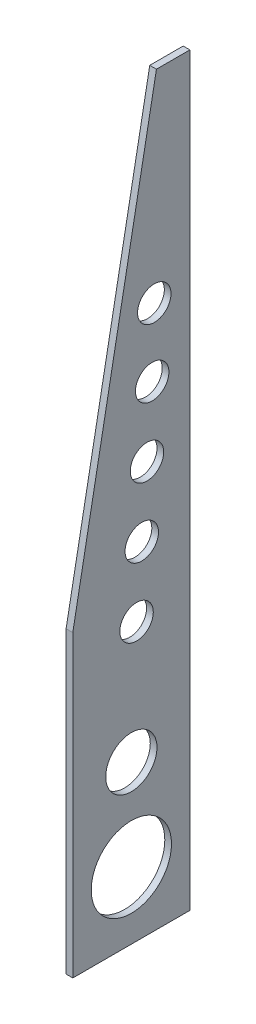
ISO-10303-21;
HEADER;
FILE_DESCRIPTION(('STEP AP214'),'2;1');
FILE_NAME('part.step','',(''),(''),'','','');
FILE_SCHEMA(('AUTOMOTIVE_DESIGN { 1 0 10303 214 1 1 1 1 }'));
ENDSEC;
DATA;
#1=APPLICATION_CONTEXT('core data for automotive mechanical design processes');
#2=APPLICATION_PROTOCOL_DEFINITION('international standard','automotive_design',2000,#1);
#3=PRODUCT_CONTEXT('',#1,'mechanical');
#4=PRODUCT('Part','Part','',(#3));
#5=PRODUCT_RELATED_PRODUCT_CATEGORY('part','',(#4));
#6=PRODUCT_DEFINITION_FORMATION('','',#4);
#7=PRODUCT_DEFINITION_CONTEXT('part definition',#1,'design');
#8=PRODUCT_DEFINITION('design','',#6,#7);
#9=PRODUCT_DEFINITION_SHAPE('','',#8);
#10=(LENGTH_UNIT() NAMED_UNIT(*) SI_UNIT(.MILLI.,.METRE.));
#11=(NAMED_UNIT(*) PLANE_ANGLE_UNIT() SI_UNIT($,.RADIAN.));
#12=(NAMED_UNIT(*) SI_UNIT($,.STERADIAN.) SOLID_ANGLE_UNIT());
#13=UNCERTAINTY_MEASURE_WITH_UNIT(LENGTH_MEASURE(1.E-05),#10,'distance_accuracy_value','');
#14=(GEOMETRIC_REPRESENTATION_CONTEXT(3) GLOBAL_UNCERTAINTY_ASSIGNED_CONTEXT((#13)) GLOBAL_UNIT_ASSIGNED_CONTEXT((#10,
#11,#12)) REPRESENTATION_CONTEXT('',''));
#15=CARTESIAN_POINT('',(0.,0.,0.));
#16=DIRECTION('',(0.,0.,1.));
#17=DIRECTION('',(1.,0.,0.));
#18=AXIS2_PLACEMENT_3D('',#15,#16,#17);
#19=CARTESIAN_POINT('',(2.54,1.2665581807014E-13,-211.819533938193));
#20=DIRECTION('',(0.,0.,-1.));
#21=DIRECTION('',(0.,1.,0.));
#22=AXIS2_PLACEMENT_3D('',#19,#20,#21);
#23=PLANE('',#22);
#24=DIRECTION('',(0.,-1.,0.));
#25=VECTOR('',#24,1.);
#26=CARTESIAN_POINT('',(0.,1.2665581807014E-13,-211.819533938193));
#27=LINE('',#26,#25);
#28=CARTESIAN_POINT('',(0.,257.309346266829,-211.819533938193));
#29=VERTEX_POINT('',#28);
#30=CARTESIAN_POINT('',(0.,76.0168462668287,-211.819533938193));
#31=VERTEX_POINT('',#30);
#32=EDGE_CURVE('E156',#29,#31,#27,.T.);
#33=ORIENTED_EDGE('',*,*,#32,.F.);
#34=DIRECTION('',(1.,0.,0.));
#35=VECTOR('',#34,1.);
#36=CARTESIAN_POINT('',(2.54,257.309346266829,-211.819533938193));
#37=LINE('',#36,#35);
#38=CARTESIAN_POINT('',(2.54,257.309346266829,-211.819533938193));
#39=VERTEX_POINT('',#38);
#40=EDGE_CURVE('E11',#29,#39,#37,.T.);
#41=ORIENTED_EDGE('',*,*,#40,.T.);
#42=DIRECTION('',(0.,-1.,0.));
#43=VECTOR('',#42,1.);
#44=CARTESIAN_POINT('',(2.54,1.2665581807014E-13,-211.819533938193));
#45=LINE('',#44,#43);
#46=CARTESIAN_POINT('',(2.54,76.0168462668287,-211.819533938193));
#47=VERTEX_POINT('',#46);
#48=EDGE_CURVE('E123',#39,#47,#45,.T.);
#49=ORIENTED_EDGE('',*,*,#48,.T.);
#50=DIRECTION('',(-1.,0.,0.));
#51=VECTOR('',#50,1.);
#52=CARTESIAN_POINT('',(2.54,76.0168462668287,-211.819533938193));
#53=LINE('',#52,#51);
#54=EDGE_CURVE('E162',#47,#31,#53,.T.);
#55=ORIENTED_EDGE('',*,*,#54,.T.);
#56=EDGE_LOOP('',(#33,#41,#49,#55));
#57=FACE_BOUND('',#56,.T.);
#58=ADVANCED_FACE('F39',(#57),#23,.T.);
#59=CARTESIAN_POINT('',(2.54,358.909346266829,0.));
#60=DIRECTION('',(0.,1.,0.));
#61=DIRECTION('',(0.,0.,1.));
#62=AXIS2_PLACEMENT_3D('',#59,#60,#61);
#63=PLANE('',#62);
#64=DIRECTION('',(0.,0.,-1.));
#65=VECTOR('',#64,1.);
#66=CARTESIAN_POINT('',(0.,358.909346266829,0.));
#67=LINE('',#66,#65);
#68=CARTESIAN_POINT('',(0.,358.909346266829,-199.119533938193));
#69=VERTEX_POINT('',#68);
#70=CARTESIAN_POINT('',(0.,358.909346266829,-211.819533938193));
#71=VERTEX_POINT('',#70);
#72=EDGE_CURVE('E96',#69,#71,#67,.T.);
#73=ORIENTED_EDGE('',*,*,#72,.F.);
#74=DIRECTION('',(-1.,0.,0.));
#75=VECTOR('',#74,1.);
#76=CARTESIAN_POINT('',(2.54,358.909346266829,-199.119533938193));
#77=LINE('',#76,#75);
#78=CARTESIAN_POINT('',(2.54,358.909346266829,-199.119533938193));
#79=VERTEX_POINT('',#78);
#80=EDGE_CURVE('E48',#79,#69,#77,.T.);
#81=ORIENTED_EDGE('',*,*,#80,.F.);
#82=DIRECTION('',(0.,0.,-1.));
#83=VECTOR('',#82,1.);
#84=CARTESIAN_POINT('',(2.54,358.909346266829,0.));
#85=LINE('',#84,#83);
#86=CARTESIAN_POINT('',(2.54,358.909346266829,-211.819533938193));
#87=VERTEX_POINT('',#86);
#88=EDGE_CURVE('E93',#79,#87,#85,.T.);
#89=ORIENTED_EDGE('',*,*,#88,.T.);
#90=DIRECTION('',(-1.,0.,0.));
#91=VECTOR('',#90,1.);
#92=CARTESIAN_POINT('',(2.54,358.909346266829,-211.819533938193));
#93=LINE('',#92,#91);
#94=EDGE_CURVE('E125',#87,#71,#93,.T.);
#95=ORIENTED_EDGE('',*,*,#94,.T.);
#96=EDGE_LOOP('',(#73,#81,#89,#95));
#97=FACE_BOUND('',#96,.T.);
#98=ADVANCED_FACE('F91',(#97),#63,.T.);
#99=CARTESIAN_POINT('',(2.54,-23.8775604250257,-127.34698893347));
#100=DIRECTION('',(0.,-0.184288535050185,-0.982872186934322));
#101=DIRECTION('',(0.,0.982872186934322,-0.184288535050185));
#102=AXIS2_PLACEMENT_3D('',#99,#100,#101);
#103=PLANE('',#102);
#104=DIRECTION('',(0.,-0.982872186934322,0.184288535050185));
#105=VECTOR('',#104,1.);
#106=CARTESIAN_POINT('',(0.,-23.8775604250257,-127.34698893347));
#107=LINE('',#106,#105);
#108=CARTESIAN_POINT('',(0.,189.576012933496,-167.369533938193));
#109=VERTEX_POINT('',#108);
#110=EDGE_CURVE('E148',#69,#109,#107,.T.);
#111=ORIENTED_EDGE('',*,*,#110,.T.);
#112=DIRECTION('',(-1.,0.,0.));
#113=VECTOR('',#112,1.);
#114=CARTESIAN_POINT('',(2.54,189.576012933496,-167.369533938193));
#115=LINE('',#114,#113);
#116=CARTESIAN_POINT('',(2.54,189.576012933496,-167.369533938193));
#117=VERTEX_POINT('',#116);
#118=EDGE_CURVE('E100',#117,#109,#115,.T.);
#119=ORIENTED_EDGE('',*,*,#118,.F.);
#120=DIRECTION('',(0.,-0.982872186934322,0.184288535050185));
#121=VECTOR('',#120,1.);
#122=CARTESIAN_POINT('',(2.54,-23.8775604250257,-127.34698893347));
#123=LINE('',#122,#121);
#124=EDGE_CURVE('E103',#79,#117,#123,.T.);
#125=ORIENTED_EDGE('',*,*,#124,.F.);
#126=ORIENTED_EDGE('',*,*,#80,.T.);
#127=EDGE_LOOP('',(#111,#119,#125,#126));
#128=FACE_BOUND('',#127,.T.);
#129=ADVANCED_FACE('F104',(#128),#103,.F.);
#130=CARTESIAN_POINT('',(2.54,0.,-167.369533938193));
#131=DIRECTION('',(0.,0.,-1.));
#132=DIRECTION('',(0.,1.,0.));
#133=AXIS2_PLACEMENT_3D('',#130,#131,#132);
#134=PLANE('',#133);
#135=DIRECTION('',(0.,-1.,0.));
#136=VECTOR('',#135,1.);
#137=CARTESIAN_POINT('',(0.,0.,-167.369533938193));
#138=LINE('',#137,#136);
#139=CARTESIAN_POINT('',(0.,76.0168462668287,-167.369533938193));
#140=VERTEX_POINT('',#139);
#141=EDGE_CURVE('E150',#109,#140,#138,.T.);
#142=ORIENTED_EDGE('',*,*,#141,.T.);
#143=DIRECTION('',(-1.,0.,0.));
#144=VECTOR('',#143,1.);
#145=CARTESIAN_POINT('',(2.54,76.0168462668287,-167.369533938193));
#146=LINE('',#145,#144);
#147=CARTESIAN_POINT('',(2.54,76.0168462668287,-167.369533938193));
#148=VERTEX_POINT('',#147);
#149=EDGE_CURVE('E165',#148,#140,#146,.T.);
#150=ORIENTED_EDGE('',*,*,#149,.F.);
#151=DIRECTION('',(0.,-1.,0.));
#152=VECTOR('',#151,1.);
#153=CARTESIAN_POINT('',(2.54,0.,-167.369533938193));
#154=LINE('',#153,#152);
#155=EDGE_CURVE('E108',#117,#148,#154,.T.);
#156=ORIENTED_EDGE('',*,*,#155,.F.);
#157=ORIENTED_EDGE('',*,*,#118,.T.);
#158=EDGE_LOOP('',(#142,#150,#156,#157));
#159=FACE_BOUND('',#158,.T.);
#160=ADVANCED_FACE('F169',(#159),#134,.F.);
#161=CARTESIAN_POINT('',(2.54,76.0168462668286,0.));
#162=DIRECTION('',(0.,1.,0.));
#163=DIRECTION('',(0.,0.,1.));
#164=AXIS2_PLACEMENT_3D('',#161,#162,#163);
#165=PLANE('',#164);
#166=DIRECTION('',(0.,0.,-1.));
#167=VECTOR('',#166,1.);
#168=CARTESIAN_POINT('',(0.,76.0168462668286,0.));
#169=LINE('',#168,#167);
#170=EDGE_CURVE('E153',#140,#31,#169,.T.);
#171=ORIENTED_EDGE('',*,*,#170,.T.);
#172=ORIENTED_EDGE('',*,*,#54,.F.);
#173=DIRECTION('',(0.,0.,-1.));
#174=VECTOR('',#173,1.);
#175=CARTESIAN_POINT('',(2.54,76.0168462668286,0.));
#176=LINE('',#175,#174);
#177=EDGE_CURVE('E120',#148,#47,#176,.T.);
#178=ORIENTED_EDGE('',*,*,#177,.F.);
#179=ORIENTED_EDGE('',*,*,#149,.T.);
#180=EDGE_LOOP('',(#171,#172,#178,#179));
#181=FACE_BOUND('',#180,.T.);
#182=ADVANCED_FACE('F175',(#181),#165,.F.);
#183=CARTESIAN_POINT('',(2.54,135.865596266829,-189.594533938193));
#184=DIRECTION('',(-1.,0.,0.));
#185=DIRECTION('',(0.,0.,1.));
#186=AXIS2_PLACEMENT_3D('',#183,#184,#185);
#187=CYLINDRICAL_SURFACE('',#186,9.72343750000003);
#188=CARTESIAN_POINT('',(2.54,135.865596266829,-189.594533938193));
#189=DIRECTION('',(1.,0.,0.));
#190=DIRECTION('',(0.,0.,-1.));
#191=AXIS2_PLACEMENT_3D('',#188,#189,#190);
#192=CIRCLE('',#191,9.72343750000003);
#193=CARTESIAN_POINT('',(2.54,135.865596266829,-199.317971438193));
#194=VERTEX_POINT('',#193);
#195=EDGE_CURVE('E112',#194,#194,#192,.T.);
#196=ORIENTED_EDGE('',*,*,#195,.T.);
#197=EDGE_LOOP('',(#196));
#198=FACE_BOUND('',#197,.T.);
#199=CARTESIAN_POINT('',(0.,135.865596266829,-189.594533938193));
#200=DIRECTION('',(1.,0.,0.));
#201=DIRECTION('',(0.,0.,-1.));
#202=AXIS2_PLACEMENT_3D('',#199,#200,#201);
#203=CIRCLE('',#202,9.72343750000003);
#204=CARTESIAN_POINT('',(0.,135.865596266829,-199.317971438193));
#205=VERTEX_POINT('',#204);
#206=EDGE_CURVE('E144',#205,#205,#203,.T.);
#207=ORIENTED_EDGE('',*,*,#206,.F.);
#208=EDGE_LOOP('',(#207));
#209=FACE_BOUND('',#208,.T.);
#210=ADVANCED_FACE('F200',(#198,#209),#187,.F.);
#211=CARTESIAN_POINT('',(2.54,101.416846266829,-189.594533938193));
#212=DIRECTION('',(-1.,0.,0.));
#213=DIRECTION('',(0.,0.,1.));
#214=AXIS2_PLACEMENT_3D('',#211,#212,#213);
#215=CYLINDRICAL_SURFACE('',#214,15.24);
#216=CARTESIAN_POINT('',(2.54,101.416846266829,-189.594533938193));
#217=DIRECTION('',(1.,0.,0.));
#218=DIRECTION('',(0.,0.,-1.));
#219=AXIS2_PLACEMENT_3D('',#216,#217,#218);
#220=CIRCLE('',#219,15.24);
#221=CARTESIAN_POINT('',(2.54,101.416846266829,-204.834533938193));
#222=VERTEX_POINT('',#221);
#223=EDGE_CURVE('E115',#222,#222,#220,.T.);
#224=ORIENTED_EDGE('',*,*,#223,.T.);
#225=EDGE_LOOP('',(#224));
#226=FACE_BOUND('',#225,.T.);
#227=CARTESIAN_POINT('',(0.,101.416846266829,-189.594533938193));
#228=DIRECTION('',(1.,0.,0.));
#229=DIRECTION('',(0.,0.,-1.));
#230=AXIS2_PLACEMENT_3D('',#227,#228,#229);
#231=CIRCLE('',#230,15.24);
#232=CARTESIAN_POINT('',(0.,101.416846266829,-204.834533938193));
#233=VERTEX_POINT('',#232);
#234=EDGE_CURVE('E141',#233,#233,#231,.T.);
#235=ORIENTED_EDGE('',*,*,#234,.F.);
#236=EDGE_LOOP('',(#235));
#237=FACE_BOUND('',#236,.T.);
#238=ADVANCED_FACE('F203',(#226,#237),#215,.F.);
#239=CARTESIAN_POINT('',(2.54,181.032184657099,-191.572880687433));
#240=DIRECTION('',(-1.,0.,0.));
#241=DIRECTION('',(0.,0.,1.));
#242=AXIS2_PLACEMENT_3D('',#239,#240,#241);
#243=CYLINDRICAL_SURFACE('',#242,6.34999999999999);
#244=CARTESIAN_POINT('',(2.54,181.032184657099,-191.572880687433));
#245=DIRECTION('',(1.,0.,0.));
#246=DIRECTION('',(0.,0.,-1.));
#247=AXIS2_PLACEMENT_3D('',#244,#245,#246);
#248=CIRCLE('',#247,6.34999999999999);
#249=CARTESIAN_POINT('',(2.54,181.032184657099,-197.922880687433));
#250=VERTEX_POINT('',#249);
#251=EDGE_CURVE('E349',#250,#250,#248,.T.);
#252=ORIENTED_EDGE('',*,*,#251,.T.);
#253=EDGE_LOOP('',(#252));
#254=FACE_BOUND('',#253,.T.);
#255=CARTESIAN_POINT('',(0.,181.032184657099,-191.572880687433));
#256=DIRECTION('',(1.,0.,0.));
#257=DIRECTION('',(0.,0.,-1.));
#258=AXIS2_PLACEMENT_3D('',#255,#256,#257);
#259=CIRCLE('',#258,6.34999999999999);
#260=CARTESIAN_POINT('',(0.,181.032184657099,-197.922880687433));
#261=VERTEX_POINT('',#260);
#262=EDGE_CURVE('E138',#261,#261,#259,.T.);
#263=ORIENTED_EDGE('',*,*,#262,.F.);
#264=EDGE_LOOP('',(#263));
#265=FACE_BOUND('',#264,.T.);
#266=ADVANCED_FACE('F207',(#254,#265),#243,.F.);
#267=CARTESIAN_POINT('',(2.54,206.35502304737,-193.551227436673));
#268=DIRECTION('',(-1.,0.,0.));
#269=DIRECTION('',(0.,0.,1.));
#270=AXIS2_PLACEMENT_3D('',#267,#268,#269);
#271=CYLINDRICAL_SURFACE('',#270,6.34999999999999);
#272=CARTESIAN_POINT('',(2.54,206.35502304737,-193.551227436673));
#273=DIRECTION('',(1.,0.,0.));
#274=DIRECTION('',(0.,0.,-1.));
#275=AXIS2_PLACEMENT_3D('',#272,#273,#274);
#276=CIRCLE('',#275,6.34999999999999);
#277=CARTESIAN_POINT('',(2.54,206.35502304737,-199.901227436673));
#278=VERTEX_POINT('',#277);
#279=EDGE_CURVE('E342',#278,#278,#276,.T.);
#280=ORIENTED_EDGE('',*,*,#279,.T.);
#281=EDGE_LOOP('',(#280));
#282=FACE_BOUND('',#281,.T.);
#283=CARTESIAN_POINT('',(0.,206.35502304737,-193.551227436673));
#284=DIRECTION('',(1.,0.,0.));
#285=DIRECTION('',(0.,0.,-1.));
#286=AXIS2_PLACEMENT_3D('',#283,#284,#285);
#287=CIRCLE('',#286,6.34999999999999);
#288=CARTESIAN_POINT('',(0.,206.35502304737,-199.901227436673));
#289=VERTEX_POINT('',#288);
#290=EDGE_CURVE('E135',#289,#289,#287,.T.);
#291=ORIENTED_EDGE('',*,*,#290,.F.);
#292=EDGE_LOOP('',(#291));
#293=FACE_BOUND('',#292,.T.);
#294=ADVANCED_FACE('F211',(#282,#293),#271,.F.);
#295=CARTESIAN_POINT('',(2.54,231.677861437641,-195.529574185913));
#296=DIRECTION('',(-1.,0.,0.));
#297=DIRECTION('',(0.,0.,1.));
#298=AXIS2_PLACEMENT_3D('',#295,#296,#297);
#299=CYLINDRICAL_SURFACE('',#298,6.34999999999999);
#300=CARTESIAN_POINT('',(2.54,231.677861437641,-195.529574185913));
#301=DIRECTION('',(1.,0.,0.));
#302=DIRECTION('',(0.,0.,-1.));
#303=AXIS2_PLACEMENT_3D('',#300,#301,#302);
#304=CIRCLE('',#303,6.34999999999999);
#305=CARTESIAN_POINT('',(2.54,231.677861437641,-201.879574185913));
#306=VERTEX_POINT('',#305);
#307=EDGE_CURVE('E339',#306,#306,#304,.T.);
#308=ORIENTED_EDGE('',*,*,#307,.T.);
#309=EDGE_LOOP('',(#308));
#310=FACE_BOUND('',#309,.T.);
#311=CARTESIAN_POINT('',(0.,231.677861437641,-195.529574185913));
#312=DIRECTION('',(1.,0.,0.));
#313=DIRECTION('',(0.,0.,-1.));
#314=AXIS2_PLACEMENT_3D('',#311,#312,#313);
#315=CIRCLE('',#314,6.34999999999999);
#316=CARTESIAN_POINT('',(0.,231.677861437641,-201.879574185913));
#317=VERTEX_POINT('',#316);
#318=EDGE_CURVE('E132',#317,#317,#315,.T.);
#319=ORIENTED_EDGE('',*,*,#318,.F.);
#320=EDGE_LOOP('',(#319));
#321=FACE_BOUND('',#320,.T.);
#322=ADVANCED_FACE('F215',(#310,#321),#299,.F.);
#323=CARTESIAN_POINT('',(2.54,257.000699827912,-197.507920935153));
#324=DIRECTION('',(-1.,0.,0.));
#325=DIRECTION('',(0.,0.,1.));
#326=AXIS2_PLACEMENT_3D('',#323,#324,#325);
#327=CYLINDRICAL_SURFACE('',#326,6.34999999999999);
#328=CARTESIAN_POINT('',(2.54,257.000699827912,-197.507920935153));
#329=DIRECTION('',(1.,0.,0.));
#330=DIRECTION('',(0.,0.,-1.));
#331=AXIS2_PLACEMENT_3D('',#328,#329,#330);
#332=CIRCLE('',#331,6.34999999999999);
#333=CARTESIAN_POINT('',(2.54,257.000699827912,-203.857920935153));
#334=VERTEX_POINT('',#333);
#335=EDGE_CURVE('E226',#334,#334,#332,.T.);
#336=ORIENTED_EDGE('',*,*,#335,.T.);
#337=EDGE_LOOP('',(#336));
#338=FACE_BOUND('',#337,.T.);
#339=CARTESIAN_POINT('',(0.,257.000699827912,-197.507920935153));
#340=DIRECTION('',(1.,0.,0.));
#341=DIRECTION('',(0.,0.,-1.));
#342=AXIS2_PLACEMENT_3D('',#339,#340,#341);
#343=CIRCLE('',#342,6.34999999999999);
#344=CARTESIAN_POINT('',(0.,257.000699827912,-203.857920935153));
#345=VERTEX_POINT('',#344);
#346=EDGE_CURVE('E129',#345,#345,#343,.T.);
#347=ORIENTED_EDGE('',*,*,#346,.F.);
#348=EDGE_LOOP('',(#347));
#349=FACE_BOUND('',#348,.T.);
#350=ADVANCED_FACE('F185',(#338,#349),#327,.F.);
#351=CARTESIAN_POINT('',(2.54,282.388081181829,-198.308463245582));
#352=DIRECTION('',(-1.,0.,0.));
#353=DIRECTION('',(0.,0.,1.));
#354=AXIS2_PLACEMENT_3D('',#351,#352,#353);
#355=CYLINDRICAL_SURFACE('',#354,6.34999999999999);
#356=CARTESIAN_POINT('',(2.54,282.388081181829,-198.308463245582));
#357=DIRECTION('',(1.,0.,0.));
#358=DIRECTION('',(0.,0.,-1.));
#359=AXIS2_PLACEMENT_3D('',#356,#357,#358);
#360=CIRCLE('',#359,6.34999999999999);
#361=CARTESIAN_POINT('',(2.54,282.388081181829,-204.658463245582));
#362=VERTEX_POINT('',#361);
#363=EDGE_CURVE('E160',#362,#362,#360,.T.);
#364=ORIENTED_EDGE('',*,*,#363,.T.);
#365=EDGE_LOOP('',(#364));
#366=FACE_BOUND('',#365,.T.);
#367=CARTESIAN_POINT('',(0.,282.388081181829,-198.308463245582));
#368=DIRECTION('',(1.,0.,0.));
#369=DIRECTION('',(0.,0.,-1.));
#370=AXIS2_PLACEMENT_3D('',#367,#368,#369);
#371=CIRCLE('',#370,6.34999999999999);
#372=CARTESIAN_POINT('',(0.,282.388081181829,-204.658463245582));
#373=VERTEX_POINT('',#372);
#374=EDGE_CURVE('E126',#373,#373,#371,.T.);
#375=ORIENTED_EDGE('',*,*,#374,.F.);
#376=EDGE_LOOP('',(#375));
#377=FACE_BOUND('',#376,.T.);
#378=ADVANCED_FACE('F41',(#366,#377),#355,.F.);
#379=ORIENTED_EDGE('',*,*,#40,.F.);
#380=EDGE_CURVE('E157',#71,#29,#27,.T.);
#381=ORIENTED_EDGE('',*,*,#380,.F.);
#382=ORIENTED_EDGE('',*,*,#94,.F.);
#383=EDGE_CURVE('E111',#87,#39,#45,.T.);
#384=ORIENTED_EDGE('',*,*,#383,.T.);
#385=EDGE_LOOP('',(#379,#381,#382,#384));
#386=FACE_BOUND('',#385,.T.);
#387=ADVANCED_FACE('F176',(#386),#23,.T.);
#388=CARTESIAN_POINT('',(2.54,0.,0.));
#389=DIRECTION('',(1.,0.,0.));
#390=DIRECTION('',(0.,0.,-1.));
#391=AXIS2_PLACEMENT_3D('',#388,#389,#390);
#392=PLANE('',#391);
#393=ORIENTED_EDGE('',*,*,#363,.F.);
#394=EDGE_LOOP('',(#393));
#395=FACE_BOUND('',#394,.T.);
#396=ORIENTED_EDGE('',*,*,#335,.F.);
#397=EDGE_LOOP('',(#396));
#398=FACE_BOUND('',#397,.T.);
#399=ORIENTED_EDGE('',*,*,#307,.F.);
#400=EDGE_LOOP('',(#399));
#401=FACE_BOUND('',#400,.T.);
#402=ORIENTED_EDGE('',*,*,#279,.F.);
#403=EDGE_LOOP('',(#402));
#404=FACE_BOUND('',#403,.T.);
#405=ORIENTED_EDGE('',*,*,#251,.F.);
#406=EDGE_LOOP('',(#405));
#407=FACE_BOUND('',#406,.T.);
#408=ORIENTED_EDGE('',*,*,#223,.F.);
#409=EDGE_LOOP('',(#408));
#410=FACE_BOUND('',#409,.T.);
#411=ORIENTED_EDGE('',*,*,#195,.F.);
#412=EDGE_LOOP('',(#411));
#413=FACE_BOUND('',#412,.T.);
#414=ORIENTED_EDGE('',*,*,#88,.F.);
#415=ORIENTED_EDGE('',*,*,#124,.T.);
#416=ORIENTED_EDGE('',*,*,#155,.T.);
#417=ORIENTED_EDGE('',*,*,#177,.T.);
#418=ORIENTED_EDGE('',*,*,#48,.F.);
#419=ORIENTED_EDGE('',*,*,#383,.F.);
#420=EDGE_LOOP('',(#414,#415,#416,#417,#418,#419));
#421=FACE_BOUND('',#420,.T.);
#422=ADVANCED_FACE('F110',(#395,#398,#401,#404,#407,#410,#413,#421),#392,.T.);
#423=CARTESIAN_POINT('',(0.,0.,0.));
#424=DIRECTION('',(1.,0.,0.));
#425=DIRECTION('',(0.,0.,-1.));
#426=AXIS2_PLACEMENT_3D('',#423,#424,#425);
#427=PLANE('',#426);
#428=ORIENTED_EDGE('',*,*,#374,.T.);
#429=EDGE_LOOP('',(#428));
#430=FACE_BOUND('',#429,.T.);
#431=ORIENTED_EDGE('',*,*,#346,.T.);
#432=EDGE_LOOP('',(#431));
#433=FACE_BOUND('',#432,.T.);
#434=ORIENTED_EDGE('',*,*,#318,.T.);
#435=EDGE_LOOP('',(#434));
#436=FACE_BOUND('',#435,.T.);
#437=ORIENTED_EDGE('',*,*,#290,.T.);
#438=EDGE_LOOP('',(#437));
#439=FACE_BOUND('',#438,.T.);
#440=ORIENTED_EDGE('',*,*,#262,.T.);
#441=EDGE_LOOP('',(#440));
#442=FACE_BOUND('',#441,.T.);
#443=ORIENTED_EDGE('',*,*,#234,.T.);
#444=EDGE_LOOP('',(#443));
#445=FACE_BOUND('',#444,.T.);
#446=ORIENTED_EDGE('',*,*,#206,.T.);
#447=EDGE_LOOP('',(#446));
#448=FACE_BOUND('',#447,.T.);
#449=ORIENTED_EDGE('',*,*,#72,.T.);
#450=ORIENTED_EDGE('',*,*,#380,.T.);
#451=ORIENTED_EDGE('',*,*,#32,.T.);
#452=ORIENTED_EDGE('',*,*,#170,.F.);
#453=ORIENTED_EDGE('',*,*,#141,.F.);
#454=ORIENTED_EDGE('',*,*,#110,.F.);
#455=EDGE_LOOP('',(#449,#450,#451,#452,#453,#454));
#456=FACE_BOUND('',#455,.T.);
#457=ADVANCED_FACE('F172',(#430,#433,#436,#439,#442,#445,#448,#456),#427,.F.);
#458=CLOSED_SHELL('',(#58,#98,#129,#160,#182,#210,#238,#266,#294,#322,#350,#378,#387,#422,#457));
#459=MANIFOLD_SOLID_BREP('B2',#458);
#460=ADVANCED_BREP_SHAPE_REPRESENTATION('',(#18,#459),#14);
#461=SHAPE_DEFINITION_REPRESENTATION(#9,#460);
ENDSEC;
END-ISO-10303-21;
